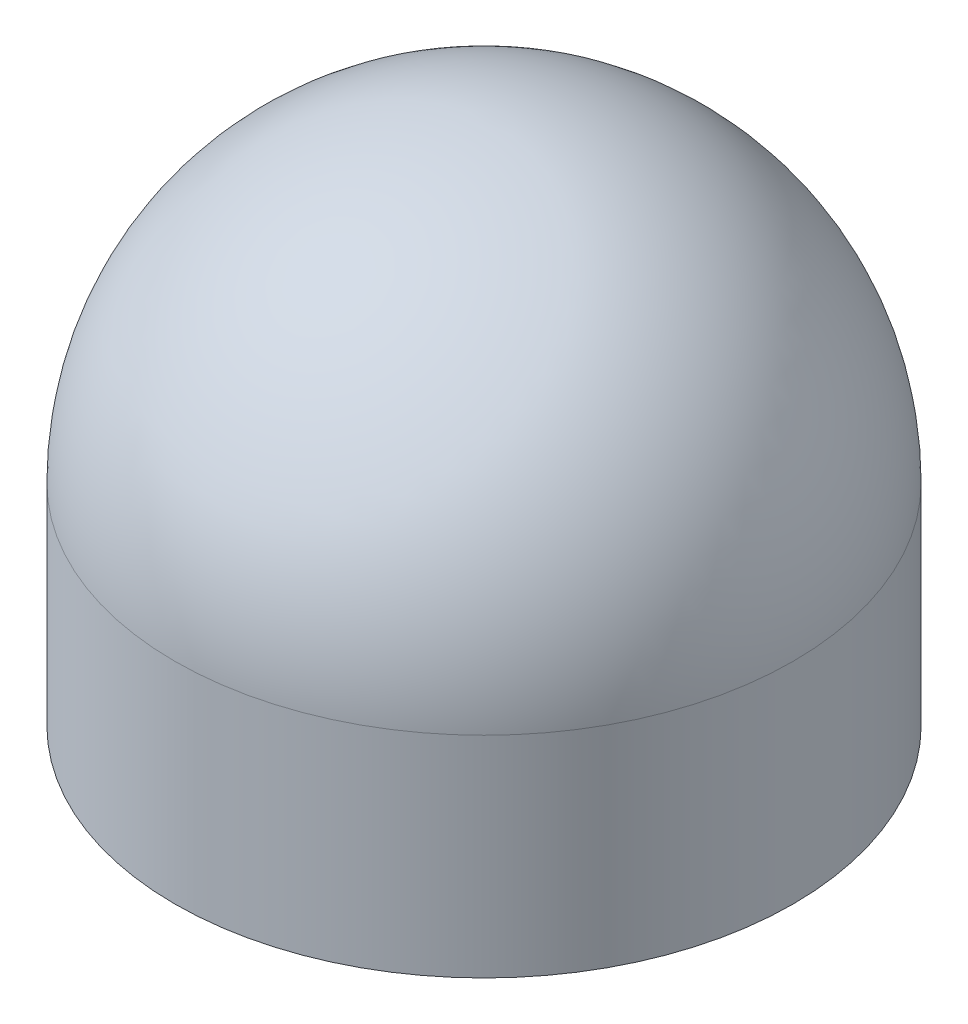
ISO-10303-21;
HEADER;
FILE_DESCRIPTION(('STEP AP214'),'2;1');
FILE_NAME('part.step','',(''),(''),'','','');
FILE_SCHEMA(('AUTOMOTIVE_DESIGN { 1 0 10303 214 1 1 1 1 }'));
ENDSEC;
DATA;
#1=APPLICATION_CONTEXT('core data for automotive mechanical design processes');
#2=APPLICATION_PROTOCOL_DEFINITION('international standard','automotive_design',2000,#1);
#3=PRODUCT_CONTEXT('',#1,'mechanical');
#4=PRODUCT('Part','Part','',(#3));
#5=PRODUCT_RELATED_PRODUCT_CATEGORY('part','',(#4));
#6=PRODUCT_DEFINITION_FORMATION('','',#4);
#7=PRODUCT_DEFINITION_CONTEXT('part definition',#1,'design');
#8=PRODUCT_DEFINITION('design','',#6,#7);
#9=PRODUCT_DEFINITION_SHAPE('','',#8);
#10=(LENGTH_UNIT() NAMED_UNIT(*) SI_UNIT(.MILLI.,.METRE.));
#11=(NAMED_UNIT(*) PLANE_ANGLE_UNIT() SI_UNIT($,.RADIAN.));
#12=(NAMED_UNIT(*) SI_UNIT($,.STERADIAN.) SOLID_ANGLE_UNIT());
#13=UNCERTAINTY_MEASURE_WITH_UNIT(LENGTH_MEASURE(1.E-05),#10,'distance_accuracy_value','');
#14=(GEOMETRIC_REPRESENTATION_CONTEXT(3) GLOBAL_UNCERTAINTY_ASSIGNED_CONTEXT((#13)) GLOBAL_UNIT_ASSIGNED_CONTEXT((#10,
#11,#12)) REPRESENTATION_CONTEXT('',''));
#15=CARTESIAN_POINT('',(0.,0.,0.));
#16=DIRECTION('',(0.,0.,1.));
#17=DIRECTION('',(1.,0.,0.));
#18=AXIS2_PLACEMENT_3D('',#15,#16,#17);
#19=CARTESIAN_POINT('',(0.,12.6,0.));
#20=DIRECTION('',(0.,-1.,0.));
#21=DIRECTION('',(0.,0.,-1.));
#22=AXIS2_PLACEMENT_3D('',#19,#20,#21);
#23=CYLINDRICAL_SURFACE('',#22,7.5);
#24=CARTESIAN_POINT('',(0.,5.1,0.));
#25=DIRECTION('',(0.,-1.,0.));
#26=DIRECTION('',(0.,0.,-1.));
#27=AXIS2_PLACEMENT_3D('',#24,#25,#26);
#28=CIRCLE('',#27,7.5);
#29=CARTESIAN_POINT('',(0.,5.1,-7.5));
#30=VERTEX_POINT('',#29);
#31=EDGE_CURVE('E10',#30,#30,#28,.T.);
#32=ORIENTED_EDGE('',*,*,#31,.T.);
#33=EDGE_LOOP('',(#32));
#34=FACE_BOUND('',#33,.T.);
#35=CARTESIAN_POINT('',(0.,0.,0.));
#36=DIRECTION('',(0.,1.,0.));
#37=DIRECTION('',(0.,0.,1.));
#38=AXIS2_PLACEMENT_3D('',#35,#36,#37);
#39=CIRCLE('',#38,7.5);
#40=CARTESIAN_POINT('',(0.,0.,7.5));
#41=VERTEX_POINT('',#40);
#42=EDGE_CURVE('E42',#41,#41,#39,.T.);
#43=ORIENTED_EDGE('',*,*,#42,.T.);
#44=EDGE_LOOP('',(#43));
#45=FACE_BOUND('',#44,.T.);
#46=ADVANCED_FACE('F35',(#34,#45),#23,.T.);
#47=CARTESIAN_POINT('',(0.,0.,0.));
#48=DIRECTION('',(0.,1.,0.));
#49=DIRECTION('',(0.,0.,1.));
#50=AXIS2_PLACEMENT_3D('',#47,#48,#49);
#51=PLANE('',#50);
#52=CARTESIAN_POINT('',(0.,0.,0.));
#53=DIRECTION('',(0.,-1.,0.));
#54=DIRECTION('',(0.,0.,-1.));
#55=AXIS2_PLACEMENT_3D('',#52,#53,#54);
#56=CIRCLE('',#55,1.625);
#57=CARTESIAN_POINT('',(0.,0.,-1.625));
#58=VERTEX_POINT('',#57);
#59=EDGE_CURVE('E50',#58,#58,#56,.T.);
#60=ORIENTED_EDGE('',*,*,#59,.F.);
#61=EDGE_LOOP('',(#60));
#62=FACE_BOUND('',#61,.T.);
#63=ORIENTED_EDGE('',*,*,#42,.F.);
#64=EDGE_LOOP('',(#63));
#65=FACE_BOUND('',#64,.T.);
#66=ADVANCED_FACE('F58',(#62,#65),#51,.F.);
#67=CARTESIAN_POINT('',(0.,5.1,0.));
#68=DIRECTION('',(0.,1.,0.));
#69=DIRECTION('',(0.,0.,1.));
#70=AXIS2_PLACEMENT_3D('',#67,#68,#69);
#71=SPHERICAL_SURFACE('',#70,7.5);
#72=ORIENTED_EDGE('',*,*,#31,.F.);
#73=EDGE_LOOP('',(#72));
#74=FACE_BOUND('',#73,.T.);
#75=ADVANCED_FACE('F37',(#74),#71,.T.);
#76=CARTESIAN_POINT('',(0.,12.,0.));
#77=DIRECTION('',(0.,-1.,0.));
#78=DIRECTION('',(0.,0.,-1.));
#79=AXIS2_PLACEMENT_3D('',#76,#77,#78);
#80=CYLINDRICAL_SURFACE('',#79,1.625);
#81=CARTESIAN_POINT('',(0.,12.,0.));
#82=DIRECTION('',(0.,-1.,0.));
#83=DIRECTION('',(0.,0.,-1.));
#84=AXIS2_PLACEMENT_3D('',#81,#82,#83);
#85=CIRCLE('',#84,1.625);
#86=CARTESIAN_POINT('',(0.,12.,-1.625));
#87=VERTEX_POINT('',#86);
#88=EDGE_CURVE('E46',#87,#87,#85,.T.);
#89=ORIENTED_EDGE('',*,*,#88,.F.);
#90=EDGE_LOOP('',(#89));
#91=FACE_BOUND('',#90,.T.);
#92=ORIENTED_EDGE('',*,*,#59,.T.);
#93=EDGE_LOOP('',(#92));
#94=FACE_BOUND('',#93,.T.);
#95=ADVANCED_FACE('F56',(#91,#94),#80,.F.);
#96=CARTESIAN_POINT('',(0.,12.,0.));
#97=DIRECTION('',(0.,-1.,0.));
#98=DIRECTION('',(0.,0.,-1.));
#99=AXIS2_PLACEMENT_3D('',#96,#97,#98);
#100=PLANE('',#99);
#101=ORIENTED_EDGE('',*,*,#88,.T.);
#102=EDGE_LOOP('',(#101));
#103=FACE_BOUND('',#102,.T.);
#104=ADVANCED_FACE('F70',(#103),#100,.T.);
#105=CLOSED_SHELL('',(#46,#66,#75,#95,#104));
#106=MANIFOLD_SOLID_BREP('B2',#105);
#107=ADVANCED_BREP_SHAPE_REPRESENTATION('',(#18,#106),#14);
#108=SHAPE_DEFINITION_REPRESENTATION(#9,#107);
ENDSEC;
END-ISO-10303-21;
